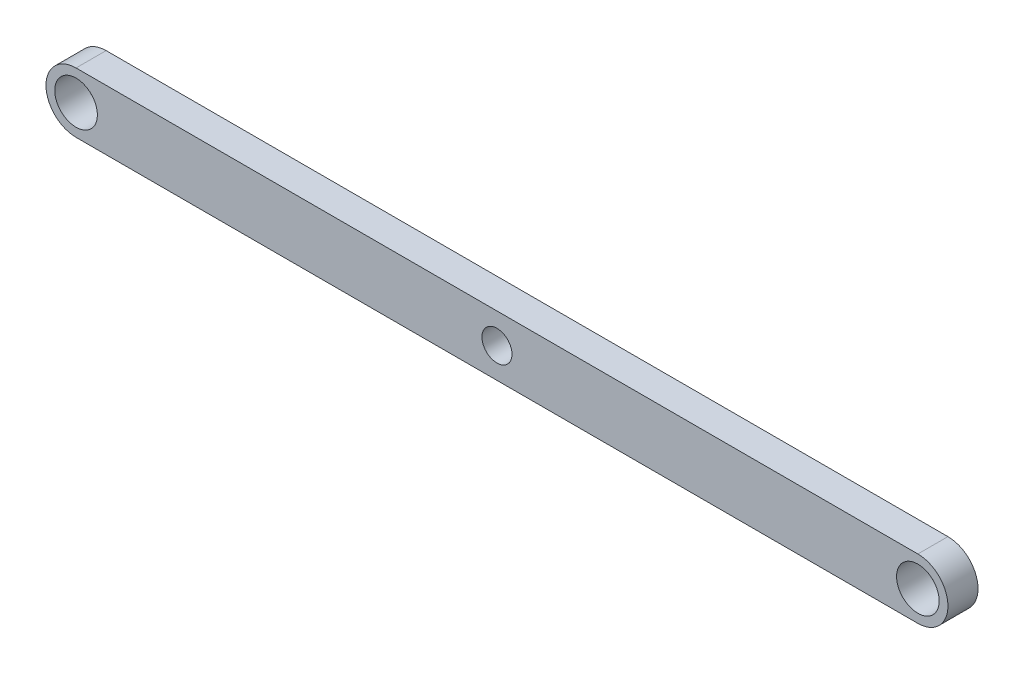
ISO-10303-21;
HEADER;
FILE_DESCRIPTION(('STEP AP214'),'2;1');
FILE_NAME('part.step','',(''),(''),'','','');
FILE_SCHEMA(('AUTOMOTIVE_DESIGN { 1 0 10303 214 1 1 1 1 }'));
ENDSEC;
DATA;
#1=APPLICATION_CONTEXT('core data for automotive mechanical design processes');
#2=APPLICATION_PROTOCOL_DEFINITION('international standard','automotive_design',2000,#1);
#3=PRODUCT_CONTEXT('',#1,'mechanical');
#4=PRODUCT('Part','Part','',(#3));
#5=PRODUCT_RELATED_PRODUCT_CATEGORY('part','',(#4));
#6=PRODUCT_DEFINITION_FORMATION('','',#4);
#7=PRODUCT_DEFINITION_CONTEXT('part definition',#1,'design');
#8=PRODUCT_DEFINITION('design','',#6,#7);
#9=PRODUCT_DEFINITION_SHAPE('','',#8);
#10=(LENGTH_UNIT() NAMED_UNIT(*) SI_UNIT(.MILLI.,.METRE.));
#11=(NAMED_UNIT(*) PLANE_ANGLE_UNIT() SI_UNIT($,.RADIAN.));
#12=(NAMED_UNIT(*) SI_UNIT($,.STERADIAN.) SOLID_ANGLE_UNIT());
#13=UNCERTAINTY_MEASURE_WITH_UNIT(LENGTH_MEASURE(1.E-05),#10,'distance_accuracy_value','');
#14=(GEOMETRIC_REPRESENTATION_CONTEXT(3) GLOBAL_UNCERTAINTY_ASSIGNED_CONTEXT((#13)) GLOBAL_UNIT_ASSIGNED_CONTEXT((#10,
#11,#12)) REPRESENTATION_CONTEXT('',''));
#15=CARTESIAN_POINT('',(0.,0.,0.));
#16=DIRECTION('',(0.,0.,1.));
#17=DIRECTION('',(1.,0.,0.));
#18=AXIS2_PLACEMENT_3D('',#15,#16,#17);
#19=CARTESIAN_POINT('',(0.,-6.34999999999998,6.35));
#20=DIRECTION('',(0.,1.,0.));
#21=DIRECTION('',(-1.,0.,0.));
#22=AXIS2_PLACEMENT_3D('',#19,#20,#21);
#23=PLANE('',#22);
#24=DIRECTION('',(1.,0.,0.));
#25=VECTOR('',#24,1.);
#26=CARTESIAN_POINT('',(0.,-6.34999999999998,0.));
#27=LINE('',#26,#25);
#28=CARTESIAN_POINT('',(-88.9,-6.35,0.));
#29=VERTEX_POINT('',#28);
#30=CARTESIAN_POINT('',(88.9,-6.34999999999997,0.));
#31=VERTEX_POINT('',#30);
#32=EDGE_CURVE('E125',#29,#31,#27,.T.);
#33=ORIENTED_EDGE('',*,*,#32,.T.);
#34=DIRECTION('',(0.,0.,-1.));
#35=VECTOR('',#34,1.);
#36=CARTESIAN_POINT('',(88.9,-6.34999999999997,6.35));
#37=LINE('',#36,#35);
#38=CARTESIAN_POINT('',(88.9,-6.34999999999997,6.35));
#39=VERTEX_POINT('',#38);
#40=EDGE_CURVE('E11',#39,#31,#37,.T.);
#41=ORIENTED_EDGE('',*,*,#40,.F.);
#42=DIRECTION('',(1.,0.,0.));
#43=VECTOR('',#42,1.);
#44=CARTESIAN_POINT('',(0.,-6.34999999999998,6.35));
#45=LINE('',#44,#43);
#46=CARTESIAN_POINT('',(-88.9,-6.35,6.35));
#47=VERTEX_POINT('',#46);
#48=EDGE_CURVE('E94',#47,#39,#45,.T.);
#49=ORIENTED_EDGE('',*,*,#48,.F.);
#50=DIRECTION('',(0.,0.,-1.));
#51=VECTOR('',#50,1.);
#52=CARTESIAN_POINT('',(-88.9,-6.35,6.35));
#53=LINE('',#52,#51);
#54=EDGE_CURVE('E109',#47,#29,#53,.T.);
#55=ORIENTED_EDGE('',*,*,#54,.T.);
#56=EDGE_LOOP('',(#33,#41,#49,#55));
#57=FACE_BOUND('',#56,.T.);
#58=ADVANCED_FACE('F45',(#57),#23,.F.);
#59=CARTESIAN_POINT('',(88.9,0.,6.35));
#60=DIRECTION('',(0.,0.,-1.));
#61=DIRECTION('',(-1.,0.,0.));
#62=AXIS2_PLACEMENT_3D('',#59,#60,#61);
#63=CYLINDRICAL_SURFACE('',#62,6.35);
#64=CARTESIAN_POINT('',(88.9,0.,0.));
#65=DIRECTION('',(0.,0.,1.));
#66=DIRECTION('',(1.,0.,0.));
#67=AXIS2_PLACEMENT_3D('',#64,#65,#66);
#68=CIRCLE('',#67,6.35);
#69=CARTESIAN_POINT('',(88.9,6.35000000000003,0.));
#70=VERTEX_POINT('',#69);
#71=EDGE_CURVE('E100',#31,#70,#68,.T.);
#72=ORIENTED_EDGE('',*,*,#71,.T.);
#73=DIRECTION('',(0.,0.,-1.));
#74=VECTOR('',#73,1.);
#75=CARTESIAN_POINT('',(88.9,6.35000000000003,6.35));
#76=LINE('',#75,#74);
#77=CARTESIAN_POINT('',(88.9,6.35000000000003,6.35));
#78=VERTEX_POINT('',#77);
#79=EDGE_CURVE('E55',#78,#70,#76,.T.);
#80=ORIENTED_EDGE('',*,*,#79,.F.);
#81=CARTESIAN_POINT('',(88.9,0.,6.35));
#82=DIRECTION('',(0.,0.,1.));
#83=DIRECTION('',(1.,0.,0.));
#84=AXIS2_PLACEMENT_3D('',#81,#82,#83);
#85=CIRCLE('',#84,6.35);
#86=EDGE_CURVE('E89',#39,#78,#85,.T.);
#87=ORIENTED_EDGE('',*,*,#86,.F.);
#88=ORIENTED_EDGE('',*,*,#40,.T.);
#89=EDGE_LOOP('',(#72,#80,#87,#88));
#90=FACE_BOUND('',#89,.T.);
#91=ADVANCED_FACE('F99',(#90),#63,.T.);
#92=CARTESIAN_POINT('',(0.,6.35000000000002,6.35));
#93=DIRECTION('',(0.,1.,0.));
#94=DIRECTION('',(-1.,0.,0.));
#95=AXIS2_PLACEMENT_3D('',#92,#93,#94);
#96=PLANE('',#95);
#97=DIRECTION('',(1.,0.,0.));
#98=VECTOR('',#97,1.);
#99=CARTESIAN_POINT('',(0.,6.35000000000002,0.));
#100=LINE('',#99,#98);
#101=CARTESIAN_POINT('',(-88.9,6.35,0.));
#102=VERTEX_POINT('',#101);
#103=EDGE_CURVE('E131',#102,#70,#100,.T.);
#104=ORIENTED_EDGE('',*,*,#103,.F.);
#105=DIRECTION('',(0.,0.,-1.));
#106=VECTOR('',#105,1.);
#107=CARTESIAN_POINT('',(-88.9,6.35,6.35));
#108=LINE('',#107,#106);
#109=CARTESIAN_POINT('',(-88.9,6.35,6.35));
#110=VERTEX_POINT('',#109);
#111=EDGE_CURVE('E79',#110,#102,#108,.T.);
#112=ORIENTED_EDGE('',*,*,#111,.F.);
#113=DIRECTION('',(1.,0.,0.));
#114=VECTOR('',#113,1.);
#115=CARTESIAN_POINT('',(0.,6.35000000000002,6.35));
#116=LINE('',#115,#114);
#117=EDGE_CURVE('E92',#110,#78,#116,.T.);
#118=ORIENTED_EDGE('',*,*,#117,.T.);
#119=ORIENTED_EDGE('',*,*,#79,.T.);
#120=EDGE_LOOP('',(#104,#112,#118,#119));
#121=FACE_BOUND('',#120,.T.);
#122=ADVANCED_FACE('F105',(#121),#96,.T.);
#123=CARTESIAN_POINT('',(-88.9,0.,6.35));
#124=DIRECTION('',(0.,0.,-1.));
#125=DIRECTION('',(-1.,0.,0.));
#126=AXIS2_PLACEMENT_3D('',#123,#124,#125);
#127=CYLINDRICAL_SURFACE('',#126,4.5);
#128=CARTESIAN_POINT('',(-88.9,0.,6.35));
#129=DIRECTION('',(0.,0.,1.));
#130=DIRECTION('',(1.,0.,0.));
#131=AXIS2_PLACEMENT_3D('',#128,#129,#130);
#132=CIRCLE('',#131,4.5);
#133=CARTESIAN_POINT('',(-84.4,0.,6.35));
#134=VERTEX_POINT('',#133);
#135=EDGE_CURVE('E183',#134,#134,#132,.T.);
#136=ORIENTED_EDGE('',*,*,#135,.T.);
#137=EDGE_LOOP('',(#136));
#138=FACE_BOUND('',#137,.T.);
#139=CARTESIAN_POINT('',(-88.9,0.,0.));
#140=DIRECTION('',(0.,0.,1.));
#141=DIRECTION('',(1.,0.,0.));
#142=AXIS2_PLACEMENT_3D('',#139,#140,#141);
#143=CIRCLE('',#142,4.5);
#144=CARTESIAN_POINT('',(-84.4,0.,0.));
#145=VERTEX_POINT('',#144);
#146=EDGE_CURVE('E121',#145,#145,#143,.T.);
#147=ORIENTED_EDGE('',*,*,#146,.F.);
#148=EDGE_LOOP('',(#147));
#149=FACE_BOUND('',#148,.T.);
#150=ADVANCED_FACE('F163',(#138,#149),#127,.F.);
#151=CARTESIAN_POINT('',(88.9,0.,6.35));
#152=DIRECTION('',(0.,0.,-1.));
#153=DIRECTION('',(-1.,0.,0.));
#154=AXIS2_PLACEMENT_3D('',#151,#152,#153);
#155=CYLINDRICAL_SURFACE('',#154,4.5);
#156=CARTESIAN_POINT('',(88.9,0.,6.35));
#157=DIRECTION('',(0.,0.,1.));
#158=DIRECTION('',(1.,0.,0.));
#159=AXIS2_PLACEMENT_3D('',#156,#157,#158);
#160=CIRCLE('',#159,4.5);
#161=CARTESIAN_POINT('',(93.4,0.,6.35));
#162=VERTEX_POINT('',#161);
#163=EDGE_CURVE('E176',#162,#162,#160,.T.);
#164=ORIENTED_EDGE('',*,*,#163,.T.);
#165=EDGE_LOOP('',(#164));
#166=FACE_BOUND('',#165,.T.);
#167=CARTESIAN_POINT('',(88.9,0.,0.));
#168=DIRECTION('',(0.,0.,1.));
#169=DIRECTION('',(1.,0.,0.));
#170=AXIS2_PLACEMENT_3D('',#167,#168,#169);
#171=CIRCLE('',#170,4.5);
#172=CARTESIAN_POINT('',(93.4,0.,0.));
#173=VERTEX_POINT('',#172);
#174=EDGE_CURVE('E117',#173,#173,#171,.T.);
#175=ORIENTED_EDGE('',*,*,#174,.F.);
#176=EDGE_LOOP('',(#175));
#177=FACE_BOUND('',#176,.T.);
#178=ADVANCED_FACE('F165',(#166,#177),#155,.F.);
#179=CARTESIAN_POINT('',(0.,0.,6.35));
#180=DIRECTION('',(0.,0.,-1.));
#181=DIRECTION('',(-1.,0.,0.));
#182=AXIS2_PLACEMENT_3D('',#179,#180,#181);
#183=CYLINDRICAL_SURFACE('',#182,3.175);
#184=CARTESIAN_POINT('',(0.,0.,6.35));
#185=DIRECTION('',(0.,0.,1.));
#186=DIRECTION('',(1.,0.,0.));
#187=AXIS2_PLACEMENT_3D('',#184,#185,#186);
#188=CIRCLE('',#187,3.175);
#189=CARTESIAN_POINT('',(3.175,0.,6.35));
#190=VERTEX_POINT('',#189);
#191=EDGE_CURVE('E136',#190,#190,#188,.T.);
#192=ORIENTED_EDGE('',*,*,#191,.T.);
#193=EDGE_LOOP('',(#192));
#194=FACE_BOUND('',#193,.T.);
#195=CARTESIAN_POINT('',(0.,0.,0.));
#196=DIRECTION('',(0.,0.,1.));
#197=DIRECTION('',(1.,0.,0.));
#198=AXIS2_PLACEMENT_3D('',#195,#196,#197);
#199=CIRCLE('',#198,3.175);
#200=CARTESIAN_POINT('',(3.175,0.,0.));
#201=VERTEX_POINT('',#200);
#202=EDGE_CURVE('E113',#201,#201,#199,.T.);
#203=ORIENTED_EDGE('',*,*,#202,.F.);
#204=EDGE_LOOP('',(#203));
#205=FACE_BOUND('',#204,.T.);
#206=ADVANCED_FACE('F47',(#194,#205),#183,.F.);
#207=CARTESIAN_POINT('',(-88.9,0.,6.35));
#208=DIRECTION('',(0.,0.,-1.));
#209=DIRECTION('',(-1.,0.,0.));
#210=AXIS2_PLACEMENT_3D('',#207,#208,#209);
#211=CYLINDRICAL_SURFACE('',#210,6.35);
#212=CARTESIAN_POINT('',(-88.9,0.,0.));
#213=DIRECTION('',(0.,0.,1.));
#214=DIRECTION('',(1.,0.,0.));
#215=AXIS2_PLACEMENT_3D('',#212,#213,#214);
#216=CIRCLE('',#215,6.35);
#217=EDGE_CURVE('E82',#102,#29,#216,.T.);
#218=ORIENTED_EDGE('',*,*,#217,.T.);
#219=ORIENTED_EDGE('',*,*,#54,.F.);
#220=CARTESIAN_POINT('',(-88.9,0.,6.35));
#221=DIRECTION('',(0.,0.,1.));
#222=DIRECTION('',(1.,0.,0.));
#223=AXIS2_PLACEMENT_3D('',#220,#221,#222);
#224=CIRCLE('',#223,6.35);
#225=EDGE_CURVE('E63',#110,#47,#224,.T.);
#226=ORIENTED_EDGE('',*,*,#225,.F.);
#227=ORIENTED_EDGE('',*,*,#111,.T.);
#228=EDGE_LOOP('',(#218,#219,#226,#227));
#229=FACE_BOUND('',#228,.T.);
#230=ADVANCED_FACE('F150',(#229),#211,.T.);
#231=CARTESIAN_POINT('',(0.,0.,6.35));
#232=DIRECTION('',(0.,0.,1.));
#233=DIRECTION('',(1.,0.,0.));
#234=AXIS2_PLACEMENT_3D('',#231,#232,#233);
#235=PLANE('',#234);
#236=ORIENTED_EDGE('',*,*,#191,.F.);
#237=EDGE_LOOP('',(#236));
#238=FACE_BOUND('',#237,.T.);
#239=ORIENTED_EDGE('',*,*,#163,.F.);
#240=EDGE_LOOP('',(#239));
#241=FACE_BOUND('',#240,.T.);
#242=ORIENTED_EDGE('',*,*,#135,.F.);
#243=EDGE_LOOP('',(#242));
#244=FACE_BOUND('',#243,.T.);
#245=ORIENTED_EDGE('',*,*,#48,.T.);
#246=ORIENTED_EDGE('',*,*,#86,.T.);
#247=ORIENTED_EDGE('',*,*,#117,.F.);
#248=ORIENTED_EDGE('',*,*,#225,.T.);
#249=EDGE_LOOP('',(#245,#246,#247,#248));
#250=FACE_BOUND('',#249,.T.);
#251=ADVANCED_FACE('F90',(#238,#241,#244,#250),#235,.T.);
#252=CARTESIAN_POINT('',(0.,0.,0.));
#253=DIRECTION('',(0.,0.,1.));
#254=DIRECTION('',(1.,0.,0.));
#255=AXIS2_PLACEMENT_3D('',#252,#253,#254);
#256=PLANE('',#255);
#257=ORIENTED_EDGE('',*,*,#202,.T.);
#258=EDGE_LOOP('',(#257));
#259=FACE_BOUND('',#258,.T.);
#260=ORIENTED_EDGE('',*,*,#174,.T.);
#261=EDGE_LOOP('',(#260));
#262=FACE_BOUND('',#261,.T.);
#263=ORIENTED_EDGE('',*,*,#146,.T.);
#264=EDGE_LOOP('',(#263));
#265=FACE_BOUND('',#264,.T.);
#266=ORIENTED_EDGE('',*,*,#32,.F.);
#267=ORIENTED_EDGE('',*,*,#217,.F.);
#268=ORIENTED_EDGE('',*,*,#103,.T.);
#269=ORIENTED_EDGE('',*,*,#71,.F.);
#270=EDGE_LOOP('',(#266,#267,#268,#269));
#271=FACE_BOUND('',#270,.T.);
#272=ADVANCED_FACE('F143',(#259,#262,#265,#271),#256,.F.);
#273=CLOSED_SHELL('',(#58,#91,#122,#150,#178,#206,#230,#251,#272));
#274=MANIFOLD_SOLID_BREP('B2',#273);
#275=ADVANCED_BREP_SHAPE_REPRESENTATION('',(#18,#274),#14);
#276=SHAPE_DEFINITION_REPRESENTATION(#9,#275);
ENDSEC;
END-ISO-10303-21;
